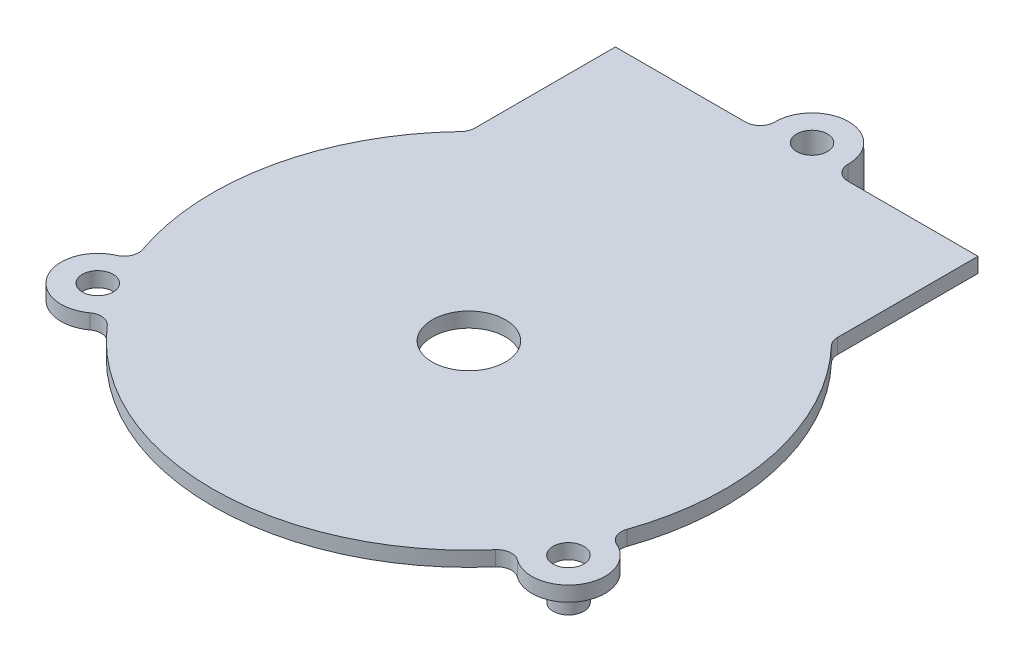
ISO-10303-21;
HEADER;
FILE_DESCRIPTION(('STEP AP214'),'2;1');
FILE_NAME('part.step','',(''),(''),'','','');
FILE_SCHEMA(('AUTOMOTIVE_DESIGN { 1 0 10303 214 1 1 1 1 }'));
ENDSEC;
DATA;
#1=APPLICATION_CONTEXT('core data for automotive mechanical design processes');
#2=APPLICATION_PROTOCOL_DEFINITION('international standard','automotive_design',2000,#1);
#3=PRODUCT_CONTEXT('',#1,'mechanical');
#4=PRODUCT('Part','Part','',(#3));
#5=PRODUCT_RELATED_PRODUCT_CATEGORY('part','',(#4));
#6=PRODUCT_DEFINITION_FORMATION('','',#4);
#7=PRODUCT_DEFINITION_CONTEXT('part definition',#1,'design');
#8=PRODUCT_DEFINITION('design','',#6,#7);
#9=PRODUCT_DEFINITION_SHAPE('','',#8);
#10=(LENGTH_UNIT() NAMED_UNIT(*) SI_UNIT(.MILLI.,.METRE.));
#11=(NAMED_UNIT(*) PLANE_ANGLE_UNIT() SI_UNIT($,.RADIAN.));
#12=(NAMED_UNIT(*) SI_UNIT($,.STERADIAN.) SOLID_ANGLE_UNIT());
#13=UNCERTAINTY_MEASURE_WITH_UNIT(LENGTH_MEASURE(1.E-05),#10,'distance_accuracy_value','');
#14=(GEOMETRIC_REPRESENTATION_CONTEXT(3) GLOBAL_UNCERTAINTY_ASSIGNED_CONTEXT((#13)) GLOBAL_UNIT_ASSIGNED_CONTEXT((#10,
#11,#12)) REPRESENTATION_CONTEXT('',''));
#15=CARTESIAN_POINT('',(0.,0.,0.));
#16=DIRECTION('',(0.,0.,1.));
#17=DIRECTION('',(1.,0.,0.));
#18=AXIS2_PLACEMENT_3D('',#15,#16,#17);
#19=CARTESIAN_POINT('',(0.,2.032,0.));
#20=DIRECTION('',(0.,-1.,0.));
#21=DIRECTION('',(0.,0.,-1.));
#22=AXIS2_PLACEMENT_3D('',#19,#20,#21);
#23=CYLINDRICAL_SURFACE('',#22,35.);
#24=CARTESIAN_POINT('',(0.,0.,0.));
#25=DIRECTION('',(0.,1.,0.));
#26=DIRECTION('',(0.,0.,1.));
#27=AXIS2_PLACEMENT_3D('',#24,#25,#26);
#28=CIRCLE('',#27,35.);
#29=CARTESIAN_POINT('',(-25.3019754085747,0.,-24.1828459951239));
#30=VERTEX_POINT('',#29);
#31=CARTESIAN_POINT('',(-33.072840065109,0.,11.4537002766671));
#32=VERTEX_POINT('',#31);
#33=EDGE_CURVE('E251',#30,#32,#28,.T.);
#34=ORIENTED_EDGE('',*,*,#33,.T.);
#35=DIRECTION('',(0.,-1.,0.));
#36=VECTOR('',#35,1.);
#37=CARTESIAN_POINT('',(-33.072840065109,2.032,11.4537002766671));
#38=LINE('',#37,#36);
#39=CARTESIAN_POINT('',(-33.072840065109,2.032,11.4537002766671));
#40=VERTEX_POINT('',#39);
#41=EDGE_CURVE('E271',#32,#40,#38,.F.);
#42=ORIENTED_EDGE('',*,*,#41,.T.);
#43=CARTESIAN_POINT('',(0.,2.032,0.));
#44=DIRECTION('',(0.,1.,0.));
#45=DIRECTION('',(0.,0.,1.));
#46=AXIS2_PLACEMENT_3D('',#43,#44,#45);
#47=CIRCLE('',#46,35.);
#48=CARTESIAN_POINT('',(-25.3019754085747,2.032,-24.1828459951239));
#49=VERTEX_POINT('',#48);
#50=EDGE_CURVE('E246',#49,#40,#47,.T.);
#51=ORIENTED_EDGE('',*,*,#50,.F.);
#52=DIRECTION('',(0.,-1.,0.));
#53=VECTOR('',#52,1.);
#54=CARTESIAN_POINT('',(-25.3019754085747,2.032,-24.1828459951239));
#55=LINE('',#54,#53);
#56=EDGE_CURVE('E265',#49,#30,#55,.T.);
#57=ORIENTED_EDGE('',*,*,#56,.T.);
#58=EDGE_LOOP('',(#34,#42,#51,#57));
#59=FACE_BOUND('',#58,.T.);
#60=ADVANCED_FACE('F43',(#59),#23,.T.);
#61=CARTESIAN_POINT('',(0.,0.,0.));
#62=DIRECTION('',(0.,1.,0.));
#63=DIRECTION('',(0.,0.,1.));
#64=AXIS2_PLACEMENT_3D('',#61,#62,#63);
#65=PLANE('',#64);
#66=CARTESIAN_POINT('',(0.,0.,0.));
#67=DIRECTION('',(0.,1.,0.));
#68=DIRECTION('',(0.,0.,1.));
#69=AXIS2_PLACEMENT_3D('',#66,#67,#68);
#70=CIRCLE('',#69,5.);
#71=CARTESIAN_POINT('',(0.,0.,5.));
#72=VERTEX_POINT('',#71);
#73=EDGE_CURVE('E618',#72,#72,#70,.F.);
#74=ORIENTED_EDGE('',*,*,#73,.F.);
#75=EDGE_LOOP('',(#74));
#76=FACE_BOUND('',#75,.T.);
#77=CARTESIAN_POINT('',(-32.1480166138315,0.,18.5087961651664));
#78=DIRECTION('',(0.,1.,0.));
#79=DIRECTION('',(0.,0.,1.));
#80=AXIS2_PLACEMENT_3D('',#77,#78,#79);
#81=CIRCLE('',#80,2.09999999999999);
#82=CARTESIAN_POINT('',(-32.1480166138315,0.,20.6087961651664));
#83=VERTEX_POINT('',#82);
#84=EDGE_CURVE('E258',#83,#83,#81,.T.);
#85=ORIENTED_EDGE('',*,*,#84,.T.);
#86=EDGE_LOOP('',(#85));
#87=FACE_BOUND('',#86,.T.);
#88=CARTESIAN_POINT('',(-26.5021889393046,0.,22.8611894140572));
#89=VERTEX_POINT('',#88);
#90=CARTESIAN_POINT('',(26.4887144081727,0.,22.8768006723464));
#91=VERTEX_POINT('',#90);
#92=EDGE_CURVE('E254',#89,#91,#28,.T.);
#93=ORIENTED_EDGE('',*,*,#92,.F.);
#94=CARTESIAN_POINT('',(-28.0165997358363,0.,24.1675430948605));
#95=DIRECTION('',(0.,1.,0.));
#96=DIRECTION('',(0.,0.,1.));
#97=AXIS2_PLACEMENT_3D('',#94,#95,#96);
#98=CIRCLE('',#97,2.);
#99=CARTESIAN_POINT('',(-29.1966357044392,0.,22.5527628891349));
#100=VERTEX_POINT('',#99);
#101=EDGE_CURVE('E286',#89,#100,#98,.T.);
#102=ORIENTED_EDGE('',*,*,#101,.T.);
#103=CARTESIAN_POINT('',(-32.1464555555357,0.,18.5161819435163));
#104=DIRECTION('',(0.,1.,0.));
#105=DIRECTION('',(0.,0.,1.));
#106=AXIS2_PLACEMENT_3D('',#103,#104,#105);
#107=CIRCLE('',#106,4.99954226749351);
#108=CARTESIAN_POINT('',(-34.1580179965192,0.,13.9391698799011));
#109=VERTEX_POINT('',#108);
#110=EDGE_CURVE('E369',#100,#109,#107,.F.);
#111=ORIENTED_EDGE('',*,*,#110,.T.);
#112=CARTESIAN_POINT('',(-34.9627166402581,0.,12.1081974353338));
#113=DIRECTION('',(0.,1.,0.));
#114=DIRECTION('',(0.,0.,1.));
#115=AXIS2_PLACEMENT_3D('',#112,#113,#114);
#116=CIRCLE('',#115,2.);
#117=EDGE_CURVE('E279',#109,#32,#116,.T.);
#118=ORIENTED_EDGE('',*,*,#117,.T.);
#119=ORIENTED_EDGE('',*,*,#33,.F.);
#120=CARTESIAN_POINT('',(-26.747802574779,0.,-25.564722909131));
#121=DIRECTION('',(0.,1.,0.));
#122=DIRECTION('',(0.,0.,1.));
#123=AXIS2_PLACEMENT_3D('',#120,#121,#122);
#124=CIRCLE('',#123,2.);
#125=CARTESIAN_POINT('',(-24.7478025747881,0.,-25.5647289504072));
#126=VERTEX_POINT('',#125);
#127=EDGE_CURVE('E269',#30,#126,#124,.T.);
#128=ORIENTED_EDGE('',*,*,#127,.T.);
#129=DIRECTION('',(3.02063810260161E-06,0.,0.999999999995438));
#130=VECTOR('',#129,1.);
#131=CARTESIAN_POINT('',(-24.7478001128037,0.,-24.7496745347634));
#132=LINE('',#131,#130);
#133=CARTESIAN_POINT('',(-24.7478605121482,0.,-44.7452325826062));
#134=VERTEX_POINT('',#133);
#135=EDGE_CURVE('E221',#134,#126,#132,.T.);
#136=ORIENTED_EDGE('',*,*,#135,.F.);
#137=DIRECTION('',(-0.999999999995438,0.,3.0206381024394E-06));
#138=VECTOR('',#137,1.);
#139=CARTESIAN_POINT('',(-24.7478605121482,0.,-44.7452325826062));
#140=LINE('',#139,#138);
#141=CARTESIAN_POINT('',(-6.99532394188785,0.,-44.7452862065945));
#142=VERTEX_POINT('',#141);
#143=EDGE_CURVE('E241',#142,#134,#140,.T.);
#144=ORIENTED_EDGE('',*,*,#143,.F.);
#145=CARTESIAN_POINT('',(-6.99532998316405,0.,-46.7452862065854));
#146=DIRECTION('',(0.,1.,0.));
#147=DIRECTION('',(0.,0.,1.));
#148=AXIS2_PLACEMENT_3D('',#145,#146,#147);
#149=CIRCLE('',#148,2.);
#150=CARTESIAN_POINT('',(-4.99551857644603,0.,-46.7727514129473));
#151=VERTEX_POINT('',#150);
#152=EDGE_CURVE('E51',#142,#151,#149,.T.);
#153=ORIENTED_EDGE('',*,*,#152,.T.);
#154=CARTESIAN_POINT('',(0.,0.,-46.8413593567393));
#155=DIRECTION('',(0.,1.,0.));
#156=DIRECTION('',(0.,0.,1.));
#157=AXIS2_PLACEMENT_3D('',#154,#155,#156);
#158=CIRCLE('',#157,4.99598968149142);
#159=CARTESIAN_POINT('',(4.99551899083441,0.,-46.7727815922561));
#160=VERTEX_POINT('',#159);
#161=EDGE_CURVE('E58',#151,#160,#158,.T.);
#162=ORIENTED_EDGE('',*,*,#161,.T.);
#163=CARTESIAN_POINT('',(6.99533056344084,0.,-46.7453284673078));
#164=DIRECTION('',(0.,1.,0.));
#165=DIRECTION('',(0.,0.,1.));
#166=AXIS2_PLACEMENT_3D('',#163,#164,#165);
#167=CIRCLE('',#166,2.);
#168=CARTESIAN_POINT('',(6.99533660471705,0.,-44.7453284673169));
#169=VERTEX_POINT('',#168);
#170=EDGE_CURVE('E325',#160,#169,#167,.T.);
#171=ORIENTED_EDGE('',*,*,#170,.T.);
#172=CARTESIAN_POINT('',(24.7475901933877,0.,-44.7453820904505));
#173=VERTEX_POINT('',#172);
#174=EDGE_CURVE('E225',#173,#169,#140,.T.);
#175=ORIENTED_EDGE('',*,*,#174,.F.);
#176=DIRECTION('',(3.02063810260161E-06,0.,0.999999999995438));
#177=VECTOR('',#176,1.);
#178=CARTESIAN_POINT('',(24.7476505927322,0.,-24.7498240426077));
#179=LINE('',#178,#177);
#180=CARTESIAN_POINT('',(24.7476481307478,0.,-25.5648784582515));
#181=VERTEX_POINT('',#180);
#182=EDGE_CURVE('E224',#173,#181,#179,.T.);
#183=ORIENTED_EDGE('',*,*,#182,.T.);
#184=CARTESIAN_POINT('',(26.7476481307387,0.,-25.5648844995277));
#185=DIRECTION('',(0.,1.,0.));
#186=DIRECTION('',(0.,0.,1.));
#187=AXIS2_PLACEMENT_3D('',#184,#185,#186);
#188=CIRCLE('',#187,2.);
#189=CARTESIAN_POINT('',(25.3018293128609,0.,-24.1829988509046));
#190=VERTEX_POINT('',#189);
#191=EDGE_CURVE('E316',#181,#190,#188,.T.);
#192=ORIENTED_EDGE('',*,*,#191,.T.);
#193=CARTESIAN_POINT('',(33.0630730181294,0.,11.4818640733046));
#194=VERTEX_POINT('',#193);
#195=EDGE_CURVE('E228',#194,#190,#28,.T.);
#196=ORIENTED_EDGE('',*,*,#195,.F.);
#197=CARTESIAN_POINT('',(34.9523914763083,0.,12.1379705917791));
#198=DIRECTION('',(0.,1.,0.));
#199=DIRECTION('',(0.,0.,1.));
#200=AXIS2_PLACEMENT_3D('',#197,#198,#199);
#201=CIRCLE('',#200,2.);
#202=CARTESIAN_POINT('',(34.147287178261,0.,13.9687647007018));
#203=VERTEX_POINT('',#202);
#204=EDGE_CURVE('E305',#194,#203,#201,.T.);
#205=ORIENTED_EDGE('',*,*,#204,.T.);
#206=CARTESIAN_POINT('',(32.1364886347761,0.,18.5412879583363));
#207=DIRECTION('',(0.,1.,0.));
#208=DIRECTION('',(0.,0.,1.));
#209=AXIS2_PLACEMENT_3D('',#206,#207,#208);
#210=CIRCLE('',#209,4.9951255964279);
#211=CARTESIAN_POINT('',(29.184359284545,0.,22.5707062815676));
#212=VERTEX_POINT('',#211);
#213=EDGE_CURVE('E203',#203,#212,#210,.F.);
#214=ORIENTED_EDGE('',*,*,#213,.T.);
#215=CARTESIAN_POINT('',(28.0023552314968,0.,24.1840464250519));
#216=DIRECTION('',(0.,1.,0.));
#217=DIRECTION('',(0.,0.,1.));
#218=AXIS2_PLACEMENT_3D('',#215,#216,#217);
#219=CIRCLE('',#218,2.);
#220=EDGE_CURVE('E298',#212,#91,#219,.T.);
#221=ORIENTED_EDGE('',*,*,#220,.T.);
#222=EDGE_LOOP('',(#93,#102,#111,#118,#119,#128,#136,#144,#153,#162,#171,#175,#183,#192,#196,
#205,#214,#221));
#223=FACE_BOUND('',#222,.T.);
#224=CARTESIAN_POINT('',(32.1364886347761,0.,18.5412879583363));
#225=DIRECTION('',(0.,1.,0.));
#226=DIRECTION('',(0.,0.,1.));
#227=AXIS2_PLACEMENT_3D('',#224,#225,#226);
#228=CIRCLE('',#227,2.10167953835313);
#229=CARTESIAN_POINT('',(30.9783950358211,0.,20.2951055366469));
#230=VERTEX_POINT('',#229);
#231=CARTESIAN_POINT('',(32.7946468671949,0.,16.5453208686698));
#232=VERTEX_POINT('',#231);
#233=EDGE_CURVE('E191',#230,#232,#228,.T.);
#234=ORIENTED_EDGE('',*,*,#233,.T.);
#235=CARTESIAN_POINT('',(32.1247811991366,0.,18.5356173256723));
#236=DIRECTION('',(0.,1.,0.));
#237=DIRECTION('',(0.,0.,1.));
#238=AXIS2_PLACEMENT_3D('',#235,#236,#237);
#239=CIRCLE('',#238,2.1);
#240=EDGE_CURVE('E185',#232,#230,#239,.T.);
#241=ORIENTED_EDGE('',*,*,#240,.T.);
#242=EDGE_LOOP('',(#234,#241));
#243=FACE_BOUND('',#242,.T.);
#244=ADVANCED_FACE('F333',(#76,#87,#223,#243),#65,.F.);
#245=ORIENTED_EDGE('',*,*,#92,.T.);
#246=DIRECTION('',(0.,-1.,0.));
#247=VECTOR('',#246,1.);
#248=CARTESIAN_POINT('',(26.4887144081727,2.032,22.8768006723464));
#249=LINE('',#248,#247);
#250=CARTESIAN_POINT('',(26.4887144081727,2.032,22.8768006723464));
#251=VERTEX_POINT('',#250);
#252=EDGE_CURVE('E290',#91,#251,#249,.F.);
#253=ORIENTED_EDGE('',*,*,#252,.T.);
#254=CARTESIAN_POINT('',(-26.5021889393046,2.032,22.8611894140572));
#255=VERTEX_POINT('',#254);
#256=EDGE_CURVE('E249',#255,#251,#47,.T.);
#257=ORIENTED_EDGE('',*,*,#256,.F.);
#258=DIRECTION('',(0.,-1.,0.));
#259=VECTOR('',#258,1.);
#260=CARTESIAN_POINT('',(-26.5021889393046,2.032,22.8611894140572));
#261=LINE('',#260,#259);
#262=EDGE_CURVE('E281',#255,#89,#261,.T.);
#263=ORIENTED_EDGE('',*,*,#262,.T.);
#264=EDGE_LOOP('',(#245,#253,#257,#263));
#265=FACE_BOUND('',#264,.T.);
#266=ADVANCED_FACE('F410',(#265),#23,.T.);
#267=CARTESIAN_POINT('',(-24.7478605121482,-53.381962685779,-44.7452325826062));
#268=DIRECTION('',(3.0206381024394E-06,0.,0.999999999995438));
#269=DIRECTION('',(0.999999999995438,0.,-3.0206381024394E-06));
#270=AXIS2_PLACEMENT_3D('',#267,#268,#269);
#271=PLANE('',#270);
#272=DIRECTION('',(0.999999999995438,0.,-3.0206381024394E-06));
#273=VECTOR('',#272,1.);
#274=CARTESIAN_POINT('',(-24.7478605121482,2.032,-44.7452325826062));
#275=LINE('',#274,#273);
#276=CARTESIAN_POINT('',(-24.7478605121482,2.032,-44.7452325826062));
#277=VERTEX_POINT('',#276);
#278=CARTESIAN_POINT('',(-6.99532394188785,2.032,-44.7452862065945));
#279=VERTEX_POINT('',#278);
#280=EDGE_CURVE('E232',#277,#279,#275,.T.);
#281=ORIENTED_EDGE('',*,*,#280,.T.);
#282=DIRECTION('',(0.,1.,0.));
#283=VECTOR('',#282,1.);
#284=CARTESIAN_POINT('',(-6.99532394188785,-53.381962685779,-44.7452862065945));
#285=LINE('',#284,#283);
#286=EDGE_CURVE('E327',#279,#142,#285,.F.);
#287=ORIENTED_EDGE('',*,*,#286,.T.);
#288=ORIENTED_EDGE('',*,*,#143,.T.);
#289=DIRECTION('',(0.,1.,0.));
#290=VECTOR('',#289,1.);
#291=CARTESIAN_POINT('',(-24.7478605121482,-53.381962685779,-44.7452325826062));
#292=LINE('',#291,#290);
#293=EDGE_CURVE('E238',#134,#277,#292,.T.);
#294=ORIENTED_EDGE('',*,*,#293,.T.);
#295=EDGE_LOOP('',(#281,#287,#288,#294));
#296=FACE_BOUND('',#295,.T.);
#297=ADVANCED_FACE('F345',(#296),#271,.F.);
#298=ORIENTED_EDGE('',*,*,#195,.T.);
#299=DIRECTION('',(0.,-1.,0.));
#300=VECTOR('',#299,1.);
#301=CARTESIAN_POINT('',(25.3018293128609,2.032,-24.1829988509046));
#302=LINE('',#301,#300);
#303=CARTESIAN_POINT('',(25.3018293128609,2.032,-24.1829988509046));
#304=VERTEX_POINT('',#303);
#305=EDGE_CURVE('E309',#190,#304,#302,.F.);
#306=ORIENTED_EDGE('',*,*,#305,.T.);
#307=CARTESIAN_POINT('',(33.0630730181294,2.032,11.4818640733046));
#308=VERTEX_POINT('',#307);
#309=EDGE_CURVE('E250',#308,#304,#47,.T.);
#310=ORIENTED_EDGE('',*,*,#309,.F.);
#311=DIRECTION('',(0.,-1.,0.));
#312=VECTOR('',#311,1.);
#313=CARTESIAN_POINT('',(33.0630730181294,2.032,11.4818640733046));
#314=LINE('',#313,#312);
#315=EDGE_CURVE('E300',#308,#194,#314,.T.);
#316=ORIENTED_EDGE('',*,*,#315,.T.);
#317=EDGE_LOOP('',(#298,#306,#310,#316));
#318=FACE_BOUND('',#317,.T.);
#319=ADVANCED_FACE('F380',(#318),#23,.T.);
#320=CARTESIAN_POINT('',(0.,2.032,0.));
#321=DIRECTION('',(0.,1.,0.));
#322=DIRECTION('',(0.,0.,1.));
#323=AXIS2_PLACEMENT_3D('',#320,#321,#322);
#324=PLANE('',#323);
#325=CARTESIAN_POINT('',(0.,2.032,0.));
#326=DIRECTION('',(0.,1.,0.));
#327=DIRECTION('',(0.,0.,1.));
#328=AXIS2_PLACEMENT_3D('',#325,#326,#327);
#329=CIRCLE('',#328,5.);
#330=CARTESIAN_POINT('',(0.,2.032,5.));
#331=VERTEX_POINT('',#330);
#332=EDGE_CURVE('E621',#331,#331,#329,.T.);
#333=ORIENTED_EDGE('',*,*,#332,.F.);
#334=EDGE_LOOP('',(#333));
#335=FACE_BOUND('',#334,.T.);
#336=CARTESIAN_POINT('',(-32.1480166138315,2.032,18.5087961651664));
#337=DIRECTION('',(0.,1.,0.));
#338=DIRECTION('',(0.,0.,1.));
#339=AXIS2_PLACEMENT_3D('',#336,#337,#338);
#340=CIRCLE('',#339,2.09999999999999);
#341=CARTESIAN_POINT('',(-32.1480166138315,2.032,20.6087961651664));
#342=VERTEX_POINT('',#341);
#343=EDGE_CURVE('E262',#342,#342,#340,.T.);
#344=ORIENTED_EDGE('',*,*,#343,.F.);
#345=EDGE_LOOP('',(#344));
#346=FACE_BOUND('',#345,.T.);
#347=DIRECTION('',(-3.02063810260161E-06,0.,-0.999999999995438));
#348=VECTOR('',#347,1.);
#349=CARTESIAN_POINT('',(-24.7478001128037,2.032,-24.7496745347634));
#350=LINE('',#349,#348);
#351=CARTESIAN_POINT('',(-24.7478025747881,2.032,-25.5647289504072));
#352=VERTEX_POINT('',#351);
#353=EDGE_CURVE('E235',#352,#277,#350,.T.);
#354=ORIENTED_EDGE('',*,*,#353,.F.);
#355=CARTESIAN_POINT('',(-26.747802574779,2.032,-25.564722909131));
#356=DIRECTION('',(0.,1.,0.));
#357=DIRECTION('',(0.,0.,1.));
#358=AXIS2_PLACEMENT_3D('',#355,#356,#357);
#359=CIRCLE('',#358,2.);
#360=EDGE_CURVE('E267',#352,#49,#359,.F.);
#361=ORIENTED_EDGE('',*,*,#360,.T.);
#362=ORIENTED_EDGE('',*,*,#50,.T.);
#363=CARTESIAN_POINT('',(-34.9627166402581,2.032,12.1081974353338));
#364=DIRECTION('',(0.,1.,0.));
#365=DIRECTION('',(0.,0.,1.));
#366=AXIS2_PLACEMENT_3D('',#363,#364,#365);
#367=CIRCLE('',#366,2.);
#368=CARTESIAN_POINT('',(-34.1580179965192,2.032,13.9391698799011));
#369=VERTEX_POINT('',#368);
#370=EDGE_CURVE('E277',#40,#369,#367,.F.);
#371=ORIENTED_EDGE('',*,*,#370,.T.);
#372=CARTESIAN_POINT('',(-32.1464555555357,2.032,18.5161819435163));
#373=DIRECTION('',(0.,1.,0.));
#374=DIRECTION('',(0.,0.,1.));
#375=AXIS2_PLACEMENT_3D('',#372,#373,#374);
#376=CIRCLE('',#375,4.99954226749351);
#377=CARTESIAN_POINT('',(-29.1966357044392,2.032,22.5527628891349));
#378=VERTEX_POINT('',#377);
#379=EDGE_CURVE('E261',#369,#378,#376,.T.);
#380=ORIENTED_EDGE('',*,*,#379,.T.);
#381=CARTESIAN_POINT('',(-28.0165997358363,2.032,24.1675430948605));
#382=DIRECTION('',(0.,1.,0.));
#383=DIRECTION('',(0.,0.,1.));
#384=AXIS2_PLACEMENT_3D('',#381,#382,#383);
#385=CIRCLE('',#384,2.);
#386=EDGE_CURVE('E288',#378,#255,#385,.F.);
#387=ORIENTED_EDGE('',*,*,#386,.T.);
#388=ORIENTED_EDGE('',*,*,#256,.T.);
#389=CARTESIAN_POINT('',(28.0023552314968,2.032,24.1840464250519));
#390=DIRECTION('',(0.,1.,0.));
#391=DIRECTION('',(0.,0.,1.));
#392=AXIS2_PLACEMENT_3D('',#389,#390,#391);
#393=CIRCLE('',#392,2.);
#394=CARTESIAN_POINT('',(29.184359284545,2.032,22.5707062815676));
#395=VERTEX_POINT('',#394);
#396=EDGE_CURVE('E296',#251,#395,#393,.F.);
#397=ORIENTED_EDGE('',*,*,#396,.T.);
#398=CARTESIAN_POINT('',(32.1364886347761,2.032,18.5412879583363));
#399=DIRECTION('',(0.,1.,0.));
#400=DIRECTION('',(0.,0.,1.));
#401=AXIS2_PLACEMENT_3D('',#398,#399,#400);
#402=CIRCLE('',#401,4.9951255964279);
#403=CARTESIAN_POINT('',(34.147287178261,2.032,13.9687647007018));
#404=VERTEX_POINT('',#403);
#405=EDGE_CURVE('E200',#395,#404,#402,.T.);
#406=ORIENTED_EDGE('',*,*,#405,.T.);
#407=CARTESIAN_POINT('',(34.9523914763083,2.032,12.1379705917791));
#408=DIRECTION('',(0.,1.,0.));
#409=DIRECTION('',(0.,0.,1.));
#410=AXIS2_PLACEMENT_3D('',#407,#408,#409);
#411=CIRCLE('',#410,2.);
#412=EDGE_CURVE('E307',#404,#308,#411,.F.);
#413=ORIENTED_EDGE('',*,*,#412,.T.);
#414=ORIENTED_EDGE('',*,*,#309,.T.);
#415=CARTESIAN_POINT('',(26.7476481307387,2.032,-25.5648844995277));
#416=DIRECTION('',(0.,1.,0.));
#417=DIRECTION('',(0.,0.,1.));
#418=AXIS2_PLACEMENT_3D('',#415,#416,#417);
#419=CIRCLE('',#418,2.);
#420=CARTESIAN_POINT('',(24.7476481307478,2.032,-25.5648784582515));
#421=VERTEX_POINT('',#420);
#422=EDGE_CURVE('E314',#304,#421,#419,.F.);
#423=ORIENTED_EDGE('',*,*,#422,.T.);
#424=DIRECTION('',(-3.02063810260161E-06,0.,-0.999999999995438));
#425=VECTOR('',#424,1.);
#426=CARTESIAN_POINT('',(24.7476505927322,2.032,-24.7498240426077));
#427=LINE('',#426,#425);
#428=CARTESIAN_POINT('',(24.7475901933877,2.032,-44.7453820904505));
#429=VERTEX_POINT('',#428);
#430=EDGE_CURVE('E220',#421,#429,#427,.T.);
#431=ORIENTED_EDGE('',*,*,#430,.T.);
#432=CARTESIAN_POINT('',(6.99533660471705,2.032,-44.7453284673169));
#433=VERTEX_POINT('',#432);
#434=EDGE_CURVE('E231',#433,#429,#275,.T.);
#435=ORIENTED_EDGE('',*,*,#434,.F.);
#436=CARTESIAN_POINT('',(6.99533056344084,2.032,-46.7453284673078));
#437=DIRECTION('',(0.,1.,0.));
#438=DIRECTION('',(0.,0.,1.));
#439=AXIS2_PLACEMENT_3D('',#436,#437,#438);
#440=CIRCLE('',#439,2.);
#441=CARTESIAN_POINT('',(4.99551899083441,2.032,-46.7727815922561));
#442=VERTEX_POINT('',#441);
#443=EDGE_CURVE('E323',#433,#442,#440,.F.);
#444=ORIENTED_EDGE('',*,*,#443,.T.);
#445=CARTESIAN_POINT('',(0.,2.032,-46.8413593567393));
#446=DIRECTION('',(0.,1.,0.));
#447=DIRECTION('',(0.,0.,1.));
#448=AXIS2_PLACEMENT_3D('',#445,#446,#447);
#449=CIRCLE('',#448,4.99598968149142);
#450=CARTESIAN_POINT('',(-4.99551857644603,2.032,-46.7727514129473));
#451=VERTEX_POINT('',#450);
#452=EDGE_CURVE('E212',#442,#451,#449,.T.);
#453=ORIENTED_EDGE('',*,*,#452,.T.);
#454=CARTESIAN_POINT('',(-6.99532998316405,2.032,-46.7452862065854));
#455=DIRECTION('',(0.,1.,0.));
#456=DIRECTION('',(0.,0.,1.));
#457=AXIS2_PLACEMENT_3D('',#454,#455,#456);
#458=CIRCLE('',#457,2.);
#459=EDGE_CURVE('E12',#451,#279,#458,.F.);
#460=ORIENTED_EDGE('',*,*,#459,.T.);
#461=ORIENTED_EDGE('',*,*,#280,.F.);
#462=EDGE_LOOP('',(#354,#361,#362,#371,#380,#387,#388,#397,#406,#413,#414,#423,#431,#435,#444,
#453,#460,#461));
#463=FACE_BOUND('',#462,.T.);
#464=CARTESIAN_POINT('',(32.1247811991366,2.032,18.5356173256723));
#465=DIRECTION('',(0.,1.,0.));
#466=DIRECTION('',(0.,0.,1.));
#467=AXIS2_PLACEMENT_3D('',#464,#465,#466);
#468=CIRCLE('',#467,2.1);
#469=CARTESIAN_POINT('',(32.1247811991366,2.032,20.6356173256723));
#470=VERTEX_POINT('',#469);
#471=EDGE_CURVE('E197',#470,#470,#468,.T.);
#472=ORIENTED_EDGE('',*,*,#471,.F.);
#473=EDGE_LOOP('',(#472));
#474=FACE_BOUND('',#473,.T.);
#475=CARTESIAN_POINT('',(0.,2.032,-46.8413593567393));
#476=DIRECTION('',(0.,1.,0.));
#477=DIRECTION('',(0.,0.,1.));
#478=AXIS2_PLACEMENT_3D('',#475,#476,#477);
#479=CIRCLE('',#478,2.09605202456873);
#480=CARTESIAN_POINT('',(0.,2.032,-44.7453073321706));
#481=VERTEX_POINT('',#480);
#482=EDGE_CURVE('E208',#481,#481,#479,.T.);
#483=ORIENTED_EDGE('',*,*,#482,.F.);
#484=EDGE_LOOP('',(#483));
#485=FACE_BOUND('',#484,.T.);
#486=ADVANCED_FACE('F342',(#335,#346,#463,#474,#485),#324,.T.);
#487=ORIENTED_EDGE('',*,*,#174,.T.);
#488=DIRECTION('',(0.,1.,0.));
#489=VECTOR('',#488,1.);
#490=CARTESIAN_POINT('',(6.99533660471705,-53.381962685779,-44.7453284673169));
#491=LINE('',#490,#489);
#492=EDGE_CURVE('E318',#169,#433,#491,.T.);
#493=ORIENTED_EDGE('',*,*,#492,.T.);
#494=ORIENTED_EDGE('',*,*,#434,.T.);
#495=DIRECTION('',(0.,1.,0.));
#496=VECTOR('',#495,1.);
#497=CARTESIAN_POINT('',(24.7475901933877,-53.381962685779,-44.7453820904505));
#498=LINE('',#497,#496);
#499=EDGE_CURVE('E237',#173,#429,#498,.T.);
#500=ORIENTED_EDGE('',*,*,#499,.F.);
#501=EDGE_LOOP('',(#487,#493,#494,#500));
#502=FACE_BOUND('',#501,.T.);
#503=ADVANCED_FACE('F379',(#502),#271,.F.);
#504=CARTESIAN_POINT('',(-24.7478001128037,-53.381962685779,-24.7496745347634));
#505=DIRECTION('',(0.999999999995438,0.,-3.02063810260161E-06));
#506=DIRECTION('',(-3.02063810260161E-06,0.,-0.999999999995438));
#507=AXIS2_PLACEMENT_3D('',#504,#505,#506);
#508=PLANE('',#507);
#509=ORIENTED_EDGE('',*,*,#135,.T.);
#510=DIRECTION('',(0.,1.,0.));
#511=VECTOR('',#510,1.);
#512=CARTESIAN_POINT('',(-24.7478025747881,2.032,-25.5647289504072));
#513=LINE('',#512,#511);
#514=EDGE_CURVE('E257',#126,#352,#513,.T.);
#515=ORIENTED_EDGE('',*,*,#514,.T.);
#516=ORIENTED_EDGE('',*,*,#353,.T.);
#517=ORIENTED_EDGE('',*,*,#293,.F.);
#518=EDGE_LOOP('',(#509,#515,#516,#517));
#519=FACE_BOUND('',#518,.T.);
#520=ADVANCED_FACE('F348',(#519),#508,.F.);
#521=CARTESIAN_POINT('',(24.7476505927322,-53.381962685779,-24.7498240426077));
#522=DIRECTION('',(0.999999999995438,0.,-3.02063810260161E-06));
#523=DIRECTION('',(-3.02063810260161E-06,0.,-0.999999999995438));
#524=AXIS2_PLACEMENT_3D('',#521,#522,#523);
#525=PLANE('',#524);
#526=ORIENTED_EDGE('',*,*,#430,.F.);
#527=DIRECTION('',(0.,-1.,0.));
#528=VECTOR('',#527,1.);
#529=CARTESIAN_POINT('',(24.7476481307478,-53.381962685779,-25.5648784582515));
#530=LINE('',#529,#528);
#531=EDGE_CURVE('E312',#421,#181,#530,.T.);
#532=ORIENTED_EDGE('',*,*,#531,.T.);
#533=ORIENTED_EDGE('',*,*,#182,.F.);
#534=ORIENTED_EDGE('',*,*,#499,.T.);
#535=EDGE_LOOP('',(#526,#532,#533,#534));
#536=FACE_BOUND('',#535,.T.);
#537=ADVANCED_FACE('F400',(#536),#525,.T.);
#538=CARTESIAN_POINT('',(0.,-3.556,-46.8413593567393));
#539=DIRECTION('',(0.,1.,0.));
#540=DIRECTION('',(0.,0.,1.));
#541=AXIS2_PLACEMENT_3D('',#538,#539,#540);
#542=CYLINDRICAL_SURFACE('',#541,4.99598968149142);
#543=CARTESIAN_POINT('',(0.,-3.556,-46.8413593567393));
#544=DIRECTION('',(0.,1.,0.));
#545=DIRECTION('',(0.,0.,1.));
#546=AXIS2_PLACEMENT_3D('',#543,#544,#545);
#547=CIRCLE('',#546,4.99598968149142);
#548=CARTESIAN_POINT('',(0.,-3.556,-41.8453696752479));
#549=VERTEX_POINT('',#548);
#550=EDGE_CURVE('E215',#549,#549,#547,.T.);
#551=ORIENTED_EDGE('',*,*,#550,.T.);
#552=EDGE_LOOP('',(#551));
#553=FACE_BOUND('',#552,.T.);
#554=ORIENTED_EDGE('',*,*,#161,.F.);
#555=DIRECTION('',(0.,1.,0.));
#556=VECTOR('',#555,1.);
#557=CARTESIAN_POINT('',(-4.99551857644604,-3.556,-46.7727514129473));
#558=LINE('',#557,#556);
#559=EDGE_CURVE('E63',#151,#451,#558,.T.);
#560=ORIENTED_EDGE('',*,*,#559,.T.);
#561=ORIENTED_EDGE('',*,*,#452,.F.);
#562=DIRECTION('',(0.,1.,0.));
#563=VECTOR('',#562,1.);
#564=CARTESIAN_POINT('',(4.99551899083441,-3.556,-46.7727815922561));
#565=LINE('',#564,#563);
#566=EDGE_CURVE('E321',#442,#160,#565,.F.);
#567=ORIENTED_EDGE('',*,*,#566,.T.);
#568=EDGE_LOOP('',(#554,#560,#561,#567));
#569=FACE_BOUND('',#568,.T.);
#570=ADVANCED_FACE('F395',(#553,#569),#542,.T.);
#571=CARTESIAN_POINT('',(0.,-3.556,-46.8413593567393));
#572=DIRECTION('',(0.,1.,0.));
#573=DIRECTION('',(0.,0.,1.));
#574=AXIS2_PLACEMENT_3D('',#571,#572,#573);
#575=PLANE('',#574);
#576=CARTESIAN_POINT('',(0.,-3.556,-46.8413593567393));
#577=DIRECTION('',(0.,1.,0.));
#578=DIRECTION('',(0.,0.,1.));
#579=AXIS2_PLACEMENT_3D('',#576,#577,#578);
#580=CIRCLE('',#579,2.09605202456873);
#581=CARTESIAN_POINT('',(0.,-3.556,-44.7453073321706));
#582=VERTEX_POINT('',#581);
#583=EDGE_CURVE('E209',#582,#582,#580,.T.);
#584=ORIENTED_EDGE('',*,*,#583,.T.);
#585=EDGE_LOOP('',(#584));
#586=FACE_BOUND('',#585,.T.);
#587=ORIENTED_EDGE('',*,*,#550,.F.);
#588=EDGE_LOOP('',(#587));
#589=FACE_BOUND('',#588,.T.);
#590=ADVANCED_FACE('F389',(#586,#589),#575,.F.);
#591=CARTESIAN_POINT('',(0.,-3.556,-46.8413593567393));
#592=DIRECTION('',(0.,1.,0.));
#593=DIRECTION('',(0.,0.,1.));
#594=AXIS2_PLACEMENT_3D('',#591,#592,#593);
#595=CYLINDRICAL_SURFACE('',#594,2.09605202456873);
#596=ORIENTED_EDGE('',*,*,#482,.T.);
#597=EDGE_LOOP('',(#596));
#598=FACE_BOUND('',#597,.T.);
#599=ORIENTED_EDGE('',*,*,#583,.F.);
#600=EDGE_LOOP('',(#599));
#601=FACE_BOUND('',#600,.T.);
#602=ADVANCED_FACE('F385',(#598,#601),#595,.F.);
#603=CARTESIAN_POINT('',(32.1364886347761,-14.1283487284507,18.5412879583363));
#604=DIRECTION('',(0.,1.,0.));
#605=DIRECTION('',(0.,0.,1.));
#606=AXIS2_PLACEMENT_3D('',#603,#604,#605);
#607=CYLINDRICAL_SURFACE('',#606,4.9951255964279);
#608=ORIENTED_EDGE('',*,*,#213,.F.);
#609=DIRECTION('',(0.,1.,0.));
#610=VECTOR('',#609,1.);
#611=CARTESIAN_POINT('',(34.147287178261,-14.1283487284507,13.9687647007018));
#612=LINE('',#611,#610);
#613=EDGE_CURVE('E303',#203,#404,#612,.T.);
#614=ORIENTED_EDGE('',*,*,#613,.T.);
#615=ORIENTED_EDGE('',*,*,#405,.F.);
#616=DIRECTION('',(0.,1.,0.));
#617=VECTOR('',#616,1.);
#618=CARTESIAN_POINT('',(29.184359284545,-14.1283487284507,22.5707062815676));
#619=LINE('',#618,#617);
#620=EDGE_CURVE('E293',#395,#212,#619,.F.);
#621=ORIENTED_EDGE('',*,*,#620,.T.);
#622=EDGE_LOOP('',(#608,#614,#615,#621));
#623=FACE_BOUND('',#622,.T.);
#624=ADVANCED_FACE('F388',(#623),#607,.T.);
#625=CARTESIAN_POINT('',(32.1364886347761,-3.556,18.5412879583363));
#626=DIRECTION('',(0.,1.,0.));
#627=DIRECTION('',(0.,0.,1.));
#628=AXIS2_PLACEMENT_3D('',#625,#626,#627);
#629=CYLINDRICAL_SURFACE('',#628,2.10167953835313);
#630=DIRECTION('',(0.,1.,0.));
#631=VECTOR('',#630,1.);
#632=CARTESIAN_POINT('',(30.9783950358211,-0.762,20.2951055366469));
#633=LINE('',#632,#631);
#634=CARTESIAN_POINT('',(30.9783950358211,-3.556,20.2951055366469));
#635=VERTEX_POINT('',#634);
#636=EDGE_CURVE('E190',#635,#230,#633,.T.);
#637=ORIENTED_EDGE('',*,*,#636,.F.);
#638=CARTESIAN_POINT('',(32.1364886347761,-3.556,18.5412879583363));
#639=DIRECTION('',(0.,1.,0.));
#640=DIRECTION('',(0.,0.,1.));
#641=AXIS2_PLACEMENT_3D('',#638,#639,#640);
#642=CIRCLE('',#641,2.10167953835313);
#643=CARTESIAN_POINT('',(32.7946468671949,-3.556,16.5453208686698));
#644=VERTEX_POINT('',#643);
#645=EDGE_CURVE('E196',#635,#644,#642,.T.);
#646=ORIENTED_EDGE('',*,*,#645,.T.);
#647=DIRECTION('',(0.,1.,0.));
#648=VECTOR('',#647,1.);
#649=CARTESIAN_POINT('',(32.7946468671949,-0.762,16.5453208686698));
#650=LINE('',#649,#648);
#651=EDGE_CURVE('E178',#232,#644,#650,.F.);
#652=ORIENTED_EDGE('',*,*,#651,.F.);
#653=ORIENTED_EDGE('',*,*,#233,.F.);
#654=EDGE_LOOP('',(#637,#646,#652,#653));
#655=FACE_BOUND('',#654,.T.);
#656=ADVANCED_FACE('F199',(#655),#629,.T.);
#657=CARTESIAN_POINT('',(0.,-3.556,0.));
#658=DIRECTION('',(0.,1.,0.));
#659=DIRECTION('',(0.,0.,1.));
#660=AXIS2_PLACEMENT_3D('',#657,#658,#659);
#661=PLANE('',#660);
#662=ORIENTED_EDGE('',*,*,#645,.F.);
#663=CARTESIAN_POINT('',(32.1247811991366,-3.556,18.5356173256723));
#664=DIRECTION('',(0.,1.,0.));
#665=DIRECTION('',(0.,0.,1.));
#666=AXIS2_PLACEMENT_3D('',#663,#664,#665);
#667=CIRCLE('',#666,2.1);
#668=EDGE_CURVE('E182',#635,#644,#667,.T.);
#669=ORIENTED_EDGE('',*,*,#668,.T.);
#670=EDGE_LOOP('',(#662,#669));
#671=FACE_BOUND('',#670,.T.);
#672=ADVANCED_FACE('F195',(#671),#661,.F.);
#673=CARTESIAN_POINT('',(32.1247811991366,2.032,18.5356173256723));
#674=DIRECTION('',(0.,1.,0.));
#675=DIRECTION('',(0.,0.,1.));
#676=AXIS2_PLACEMENT_3D('',#673,#674,#675);
#677=CYLINDRICAL_SURFACE('',#676,2.1);
#678=ORIENTED_EDGE('',*,*,#636,.T.);
#679=ORIENTED_EDGE('',*,*,#240,.F.);
#680=ORIENTED_EDGE('',*,*,#651,.T.);
#681=ORIENTED_EDGE('',*,*,#668,.F.);
#682=EDGE_LOOP('',(#678,#679,#680,#681));
#683=FACE_BOUND('',#682,.T.);
#684=ORIENTED_EDGE('',*,*,#471,.T.);
#685=EDGE_LOOP('',(#684));
#686=FACE_BOUND('',#685,.T.);
#687=ADVANCED_FACE('F180',(#683,#686),#677,.F.);
#688=CARTESIAN_POINT('',(-32.1464555555357,-14.1408409606937,18.5161819435163));
#689=DIRECTION('',(0.,1.,0.));
#690=DIRECTION('',(0.,0.,1.));
#691=AXIS2_PLACEMENT_3D('',#688,#689,#690);
#692=CYLINDRICAL_SURFACE('',#691,4.99954226749351);
#693=ORIENTED_EDGE('',*,*,#110,.F.);
#694=DIRECTION('',(0.,1.,0.));
#695=VECTOR('',#694,1.);
#696=CARTESIAN_POINT('',(-29.1966357044392,-14.1408409606937,22.5527628891349));
#697=LINE('',#696,#695);
#698=EDGE_CURVE('E284',#100,#378,#697,.T.);
#699=ORIENTED_EDGE('',*,*,#698,.T.);
#700=ORIENTED_EDGE('',*,*,#379,.F.);
#701=DIRECTION('',(0.,1.,0.));
#702=VECTOR('',#701,1.);
#703=CARTESIAN_POINT('',(-34.1580179965192,-14.1408409606937,13.9391698799011));
#704=LINE('',#703,#702);
#705=EDGE_CURVE('E274',#369,#109,#704,.F.);
#706=ORIENTED_EDGE('',*,*,#705,.T.);
#707=EDGE_LOOP('',(#693,#699,#700,#706));
#708=FACE_BOUND('',#707,.T.);
#709=ADVANCED_FACE('F367',(#708),#692,.T.);
#710=CARTESIAN_POINT('',(-32.1480166138315,2.032,18.5087961651664));
#711=DIRECTION('',(0.,1.,0.));
#712=DIRECTION('',(0.,0.,1.));
#713=AXIS2_PLACEMENT_3D('',#710,#711,#712);
#714=CYLINDRICAL_SURFACE('',#713,2.09999999999999);
#715=ORIENTED_EDGE('',*,*,#343,.T.);
#716=EDGE_LOOP('',(#715));
#717=FACE_BOUND('',#716,.T.);
#718=ORIENTED_EDGE('',*,*,#84,.F.);
#719=EDGE_LOOP('',(#718));
#720=FACE_BOUND('',#719,.T.);
#721=ADVANCED_FACE('F467',(#717,#720),#714,.F.);
#722=CARTESIAN_POINT('',(-26.747802574779,2.032,-25.564722909131));
#723=DIRECTION('',(0.,-1.,0.));
#724=DIRECTION('',(0.,0.,-1.));
#725=AXIS2_PLACEMENT_3D('',#722,#723,#724);
#726=CYLINDRICAL_SURFACE('',#725,2.);
#727=ORIENTED_EDGE('',*,*,#127,.F.);
#728=ORIENTED_EDGE('',*,*,#56,.F.);
#729=ORIENTED_EDGE('',*,*,#360,.F.);
#730=ORIENTED_EDGE('',*,*,#514,.F.);
#731=EDGE_LOOP('',(#727,#728,#729,#730));
#732=FACE_BOUND('',#731,.T.);
#733=ADVANCED_FACE('F357',(#732),#726,.F.);
#734=CARTESIAN_POINT('',(-34.9627166402581,-14.1408409606937,12.1081974353338));
#735=DIRECTION('',(0.,-1.,0.));
#736=DIRECTION('',(0.,0.,-1.));
#737=AXIS2_PLACEMENT_3D('',#734,#735,#736);
#738=CYLINDRICAL_SURFACE('',#737,2.);
#739=ORIENTED_EDGE('',*,*,#117,.F.);
#740=ORIENTED_EDGE('',*,*,#705,.F.);
#741=ORIENTED_EDGE('',*,*,#370,.F.);
#742=ORIENTED_EDGE('',*,*,#41,.F.);
#743=EDGE_LOOP('',(#739,#740,#741,#742));
#744=FACE_BOUND('',#743,.T.);
#745=ADVANCED_FACE('F360',(#744),#738,.F.);
#746=CARTESIAN_POINT('',(-28.0165997358363,-14.1408409606937,24.1675430948605));
#747=DIRECTION('',(0.,1.,0.));
#748=DIRECTION('',(0.,0.,1.));
#749=AXIS2_PLACEMENT_3D('',#746,#747,#748);
#750=CYLINDRICAL_SURFACE('',#749,2.);
#751=ORIENTED_EDGE('',*,*,#386,.F.);
#752=ORIENTED_EDGE('',*,*,#698,.F.);
#753=ORIENTED_EDGE('',*,*,#101,.F.);
#754=ORIENTED_EDGE('',*,*,#262,.F.);
#755=EDGE_LOOP('',(#751,#752,#753,#754));
#756=FACE_BOUND('',#755,.T.);
#757=ADVANCED_FACE('F460',(#756),#750,.F.);
#758=CARTESIAN_POINT('',(28.0023552314968,-14.1283487284507,24.1840464250519));
#759=DIRECTION('',(0.,-1.,0.));
#760=DIRECTION('',(0.,0.,-1.));
#761=AXIS2_PLACEMENT_3D('',#758,#759,#760);
#762=CYLINDRICAL_SURFACE('',#761,2.);
#763=ORIENTED_EDGE('',*,*,#220,.F.);
#764=ORIENTED_EDGE('',*,*,#620,.F.);
#765=ORIENTED_EDGE('',*,*,#396,.F.);
#766=ORIENTED_EDGE('',*,*,#252,.F.);
#767=EDGE_LOOP('',(#763,#764,#765,#766));
#768=FACE_BOUND('',#767,.T.);
#769=ADVANCED_FACE('F456',(#768),#762,.F.);
#770=CARTESIAN_POINT('',(34.9523914763083,-14.1283487284507,12.1379705917791));
#771=DIRECTION('',(0.,1.,0.));
#772=DIRECTION('',(0.,0.,1.));
#773=AXIS2_PLACEMENT_3D('',#770,#771,#772);
#774=CYLINDRICAL_SURFACE('',#773,2.);
#775=ORIENTED_EDGE('',*,*,#412,.F.);
#776=ORIENTED_EDGE('',*,*,#613,.F.);
#777=ORIENTED_EDGE('',*,*,#204,.F.);
#778=ORIENTED_EDGE('',*,*,#315,.F.);
#779=EDGE_LOOP('',(#775,#776,#777,#778));
#780=FACE_BOUND('',#779,.T.);
#781=ADVANCED_FACE('F451',(#780),#774,.F.);
#782=CARTESIAN_POINT('',(26.7476481307387,2.032,-25.5648844995277));
#783=DIRECTION('',(0.,-1.,0.));
#784=DIRECTION('',(0.,0.,-1.));
#785=AXIS2_PLACEMENT_3D('',#782,#783,#784);
#786=CYLINDRICAL_SURFACE('',#785,2.);
#787=ORIENTED_EDGE('',*,*,#191,.F.);
#788=ORIENTED_EDGE('',*,*,#531,.F.);
#789=ORIENTED_EDGE('',*,*,#422,.F.);
#790=ORIENTED_EDGE('',*,*,#305,.F.);
#791=EDGE_LOOP('',(#787,#788,#789,#790));
#792=FACE_BOUND('',#791,.T.);
#793=ADVANCED_FACE('F433',(#792),#786,.F.);
#794=CARTESIAN_POINT('',(6.99533056344084,-3.556,-46.7453284673078));
#795=DIRECTION('',(0.,1.,0.));
#796=DIRECTION('',(0.,0.,1.));
#797=AXIS2_PLACEMENT_3D('',#794,#795,#796);
#798=CYLINDRICAL_SURFACE('',#797,2.);
#799=ORIENTED_EDGE('',*,*,#170,.F.);
#800=ORIENTED_EDGE('',*,*,#566,.F.);
#801=ORIENTED_EDGE('',*,*,#443,.F.);
#802=ORIENTED_EDGE('',*,*,#492,.F.);
#803=EDGE_LOOP('',(#799,#800,#801,#802));
#804=FACE_BOUND('',#803,.T.);
#805=ADVANCED_FACE('F444',(#804),#798,.F.);
#806=CARTESIAN_POINT('',(-6.99532998316405,-3.556,-46.7452862065854));
#807=DIRECTION('',(0.,1.,0.));
#808=DIRECTION('',(0.,0.,1.));
#809=AXIS2_PLACEMENT_3D('',#806,#807,#808);
#810=CYLINDRICAL_SURFACE('',#809,2.);
#811=ORIENTED_EDGE('',*,*,#459,.F.);
#812=ORIENTED_EDGE('',*,*,#559,.F.);
#813=ORIENTED_EDGE('',*,*,#152,.F.);
#814=ORIENTED_EDGE('',*,*,#286,.F.);
#815=EDGE_LOOP('',(#811,#812,#813,#814));
#816=FACE_BOUND('',#815,.T.);
#817=ADVANCED_FACE('F45',(#816),#810,.F.);
#818=CARTESIAN_POINT('',(0.,-14.142135623731,0.));
#819=DIRECTION('',(0.,1.,0.));
#820=DIRECTION('',(0.,0.,1.));
#821=AXIS2_PLACEMENT_3D('',#818,#819,#820);
#822=CYLINDRICAL_SURFACE('',#821,5.);
#823=ORIENTED_EDGE('',*,*,#73,.T.);
#824=EDGE_LOOP('',(#823));
#825=FACE_BOUND('',#824,.T.);
#826=ORIENTED_EDGE('',*,*,#332,.T.);
#827=EDGE_LOOP('',(#826));
#828=FACE_BOUND('',#827,.T.);
#829=ADVANCED_FACE('F450',(#825,#828),#822,.F.);
#830=CLOSED_SHELL('',(#60,#244,#266,#297,#319,#486,#503,#520,#537,#570,#590,#602,#624,#656,#672,
#687,#709,#721,#733,#745,#757,#769,#781,#793,#805,#817,#829));
#831=MANIFOLD_SOLID_BREP('B2',#830);
#832=ADVANCED_BREP_SHAPE_REPRESENTATION('',(#18,#831),#14);
#833=SHAPE_DEFINITION_REPRESENTATION(#9,#832);
ENDSEC;
END-ISO-10303-21;
